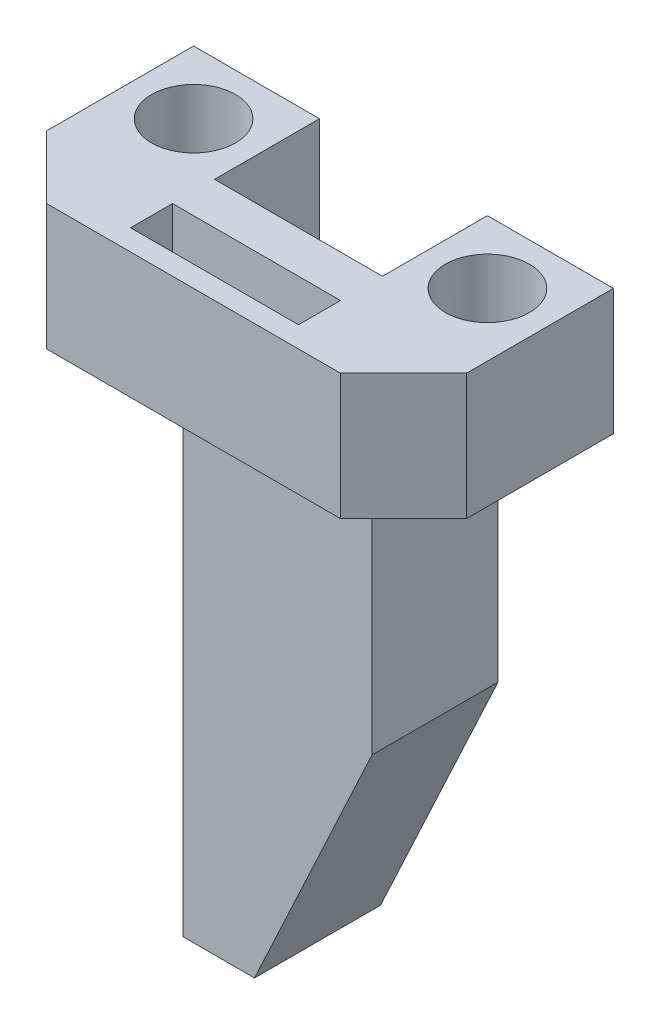
ISO-10303-21;
HEADER;
FILE_DESCRIPTION(('STEP AP214'),'2;1');
FILE_NAME('part.step','',(''),(''),'','','');
FILE_SCHEMA(('AUTOMOTIVE_DESIGN { 1 0 10303 214 1 1 1 1 }'));
ENDSEC;
DATA;
#1=APPLICATION_CONTEXT('core data for automotive mechanical design processes');
#2=APPLICATION_PROTOCOL_DEFINITION('international standard','automotive_design',2000,#1);
#3=PRODUCT_CONTEXT('',#1,'mechanical');
#4=PRODUCT('Part','Part','',(#3));
#5=PRODUCT_RELATED_PRODUCT_CATEGORY('part','',(#4));
#6=PRODUCT_DEFINITION_FORMATION('','',#4);
#7=PRODUCT_DEFINITION_CONTEXT('part definition',#1,'design');
#8=PRODUCT_DEFINITION('design','',#6,#7);
#9=PRODUCT_DEFINITION_SHAPE('','',#8);
#10=(LENGTH_UNIT() NAMED_UNIT(*) SI_UNIT(.MILLI.,.METRE.));
#11=(NAMED_UNIT(*) PLANE_ANGLE_UNIT() SI_UNIT($,.RADIAN.));
#12=(NAMED_UNIT(*) SI_UNIT($,.STERADIAN.) SOLID_ANGLE_UNIT());
#13=UNCERTAINTY_MEASURE_WITH_UNIT(LENGTH_MEASURE(1.E-05),#10,'distance_accuracy_value','');
#14=(GEOMETRIC_REPRESENTATION_CONTEXT(3) GLOBAL_UNCERTAINTY_ASSIGNED_CONTEXT((#13)) GLOBAL_UNIT_ASSIGNED_CONTEXT((#10,
#11,#12)) REPRESENTATION_CONTEXT('',''));
#15=CARTESIAN_POINT('',(0.,0.,0.));
#16=DIRECTION('',(0.,0.,1.));
#17=DIRECTION('',(1.,0.,0.));
#18=AXIS2_PLACEMENT_3D('',#15,#16,#17);
#19=CARTESIAN_POINT('',(0.,0.,0.));
#20=DIRECTION('',(0.,1.,0.));
#21=DIRECTION('',(0.,0.,1.));
#22=AXIS2_PLACEMENT_3D('',#19,#20,#21);
#23=PLANE('',#22);
#24=CARTESIAN_POINT('',(-7.,0.,-7.));
#25=DIRECTION('',(0.,1.,0.));
#26=DIRECTION('',(0.,0.,1.));
#27=AXIS2_PLACEMENT_3D('',#24,#25,#26);
#28=CIRCLE('',#27,2.);
#29=CARTESIAN_POINT('',(-7.,0.,-5.));
#30=VERTEX_POINT('',#29);
#31=EDGE_CURVE('E252',#30,#30,#28,.F.);
#32=ORIENTED_EDGE('',*,*,#31,.F.);
#33=EDGE_LOOP('',(#32));
#34=FACE_BOUND('',#33,.T.);
#35=CARTESIAN_POINT('',(7.,0.,-7.));
#36=DIRECTION('',(0.,1.,0.));
#37=DIRECTION('',(0.,0.,1.));
#38=AXIS2_PLACEMENT_3D('',#35,#36,#37);
#39=CIRCLE('',#38,2.);
#40=CARTESIAN_POINT('',(7.,0.,-5.));
#41=VERTEX_POINT('',#40);
#42=EDGE_CURVE('E246',#41,#41,#39,.F.);
#43=ORIENTED_EDGE('',*,*,#42,.F.);
#44=EDGE_LOOP('',(#43));
#45=FACE_BOUND('',#44,.T.);
#46=DIRECTION('',(1.,0.,0.));
#47=VECTOR('',#46,1.);
#48=CARTESIAN_POINT('',(-4.,0.,-3.));
#49=LINE('',#48,#47);
#50=CARTESIAN_POINT('',(-4.,0.,-3.));
#51=VERTEX_POINT('',#50);
#52=CARTESIAN_POINT('',(4.,0.,-3.));
#53=VERTEX_POINT('',#52);
#54=EDGE_CURVE('E189',#51,#53,#49,.T.);
#55=ORIENTED_EDGE('',*,*,#54,.F.);
#56=DIRECTION('',(0.,0.,-1.));
#57=VECTOR('',#56,1.);
#58=CARTESIAN_POINT('',(-4.,0.,-3.));
#59=LINE('',#58,#57);
#60=CARTESIAN_POINT('',(-4.,0.,-0.999999999999999));
#61=VERTEX_POINT('',#60);
#62=EDGE_CURVE('E217',#61,#51,#59,.T.);
#63=ORIENTED_EDGE('',*,*,#62,.F.);
#64=DIRECTION('',(-1.,0.,0.));
#65=VECTOR('',#64,1.);
#66=CARTESIAN_POINT('',(-4.,0.,-0.999999999999999));
#67=LINE('',#66,#65);
#68=CARTESIAN_POINT('',(4.,0.,-0.999999999999999));
#69=VERTEX_POINT('',#68);
#70=EDGE_CURVE('E234',#69,#61,#67,.T.);
#71=ORIENTED_EDGE('',*,*,#70,.F.);
#72=DIRECTION('',(0.,0.,1.));
#73=VECTOR('',#72,1.);
#74=CARTESIAN_POINT('',(4.,0.,-3.));
#75=LINE('',#74,#73);
#76=EDGE_CURVE('E186',#53,#69,#75,.T.);
#77=ORIENTED_EDGE('',*,*,#76,.F.);
#78=EDGE_LOOP('',(#55,#63,#71,#77));
#79=FACE_BOUND('',#78,.T.);
#80=DIRECTION('',(0.,0.,-1.));
#81=VECTOR('',#80,1.);
#82=CARTESIAN_POINT('',(-4.5,0.,-4.));
#83=LINE('',#82,#81);
#84=CARTESIAN_POINT('',(-4.5,0.,-4.));
#85=VERTEX_POINT('',#84);
#86=CARTESIAN_POINT('',(-4.5,0.,-10.));
#87=VERTEX_POINT('',#86);
#88=EDGE_CURVE('E185',#85,#87,#83,.T.);
#89=ORIENTED_EDGE('',*,*,#88,.F.);
#90=DIRECTION('',(-1.,0.,0.));
#91=VECTOR('',#90,1.);
#92=CARTESIAN_POINT('',(-4.5,0.,-4.));
#93=LINE('',#92,#91);
#94=CARTESIAN_POINT('',(4.5,0.,-4.));
#95=VERTEX_POINT('',#94);
#96=EDGE_CURVE('E182',#95,#85,#93,.T.);
#97=ORIENTED_EDGE('',*,*,#96,.F.);
#98=DIRECTION('',(0.,0.,1.));
#99=VECTOR('',#98,1.);
#100=CARTESIAN_POINT('',(4.5,0.,-4.));
#101=LINE('',#100,#99);
#102=CARTESIAN_POINT('',(4.5,0.,-10.));
#103=VERTEX_POINT('',#102);
#104=EDGE_CURVE('E213',#103,#95,#101,.T.);
#105=ORIENTED_EDGE('',*,*,#104,.F.);
#106=DIRECTION('',(-1.,0.,0.));
#107=VECTOR('',#106,1.);
#108=CARTESIAN_POINT('',(4.,0.,-10.));
#109=LINE('',#108,#107);
#110=CARTESIAN_POINT('',(10.,0.,-10.));
#111=VERTEX_POINT('',#110);
#112=EDGE_CURVE('E281',#111,#103,#109,.T.);
#113=ORIENTED_EDGE('',*,*,#112,.F.);
#114=DIRECTION('',(0.,0.,-1.));
#115=VECTOR('',#114,1.);
#116=CARTESIAN_POINT('',(10.,0.,-10.));
#117=LINE('',#116,#115);
#118=CARTESIAN_POINT('',(10.,0.,-3.));
#119=VERTEX_POINT('',#118);
#120=EDGE_CURVE('E279',#119,#111,#117,.T.);
#121=ORIENTED_EDGE('',*,*,#120,.F.);
#122=DIRECTION('',(0.707106781186549,0.,-0.707106781186546));
#123=VECTOR('',#122,1.);
#124=CARTESIAN_POINT('',(10.,0.,-3.));
#125=LINE('',#124,#123);
#126=CARTESIAN_POINT('',(6.99999999999999,0.,0.));
#127=VERTEX_POINT('',#126);
#128=EDGE_CURVE('E316',#119,#127,#125,.F.);
#129=ORIENTED_EDGE('',*,*,#128,.T.);
#130=DIRECTION('',(1.,0.,0.));
#131=VECTOR('',#130,1.);
#132=CARTESIAN_POINT('',(-10.,0.,0.));
#133=LINE('',#132,#131);
#134=CARTESIAN_POINT('',(-7.,0.,0.));
#135=VERTEX_POINT('',#134);
#136=EDGE_CURVE('E255',#135,#127,#133,.T.);
#137=ORIENTED_EDGE('',*,*,#136,.F.);
#138=DIRECTION('',(0.707106781186546,0.,0.707106781186549));
#139=VECTOR('',#138,1.);
#140=CARTESIAN_POINT('',(-7.,0.,0.));
#141=LINE('',#140,#139);
#142=CARTESIAN_POINT('',(-10.,0.,-3.00000000000001));
#143=VERTEX_POINT('',#142);
#144=EDGE_CURVE('E318',#135,#143,#141,.F.);
#145=ORIENTED_EDGE('',*,*,#144,.T.);
#146=DIRECTION('',(0.,0.,1.));
#147=VECTOR('',#146,1.);
#148=CARTESIAN_POINT('',(-10.,0.,-10.));
#149=LINE('',#148,#147);
#150=CARTESIAN_POINT('',(-10.,0.,-10.));
#151=VERTEX_POINT('',#150);
#152=EDGE_CURVE('E260',#151,#143,#149,.T.);
#153=ORIENTED_EDGE('',*,*,#152,.F.);
#154=DIRECTION('',(-1.,0.,0.));
#155=VECTOR('',#154,1.);
#156=CARTESIAN_POINT('',(-4.,0.,-10.));
#157=LINE('',#156,#155);
#158=EDGE_CURVE('E291',#87,#151,#157,.T.);
#159=ORIENTED_EDGE('',*,*,#158,.F.);
#160=EDGE_LOOP('',(#89,#97,#105,#113,#121,#129,#137,#145,#153,#159));
#161=FACE_BOUND('',#160,.T.);
#162=ADVANCED_FACE('F35',(#34,#45,#79,#161),#23,.F.);
#163=CARTESIAN_POINT('',(-10.,6.,0.));
#164=DIRECTION('',(0.,0.,-1.));
#165=DIRECTION('',(-1.,0.,0.));
#166=AXIS2_PLACEMENT_3D('',#163,#164,#165);
#167=PLANE('',#166);
#168=ORIENTED_EDGE('',*,*,#136,.T.);
#169=DIRECTION('',(0.,1.,0.));
#170=VECTOR('',#169,1.);
#171=CARTESIAN_POINT('',(6.99999999999999,6.,0.));
#172=LINE('',#171,#170);
#173=CARTESIAN_POINT('',(6.99999999999999,6.,0.));
#174=VERTEX_POINT('',#173);
#175=EDGE_CURVE('E311',#127,#174,#172,.T.);
#176=ORIENTED_EDGE('',*,*,#175,.T.);
#177=DIRECTION('',(1.,0.,0.));
#178=VECTOR('',#177,1.);
#179=CARTESIAN_POINT('',(-10.,6.,0.));
#180=LINE('',#179,#178);
#181=CARTESIAN_POINT('',(-7.,6.,0.));
#182=VERTEX_POINT('',#181);
#183=EDGE_CURVE('E259',#182,#174,#180,.T.);
#184=ORIENTED_EDGE('',*,*,#183,.F.);
#185=DIRECTION('',(0.,-1.,0.));
#186=VECTOR('',#185,1.);
#187=CARTESIAN_POINT('',(-7.,6.,0.));
#188=LINE('',#187,#186);
#189=EDGE_CURVE('E313',#182,#135,#188,.T.);
#190=ORIENTED_EDGE('',*,*,#189,.T.);
#191=EDGE_LOOP('',(#168,#176,#184,#190));
#192=FACE_BOUND('',#191,.T.);
#193=ADVANCED_FACE('F376',(#192),#167,.F.);
#194=CARTESIAN_POINT('',(10.,6.,-10.));
#195=DIRECTION('',(-1.,0.,0.));
#196=DIRECTION('',(0.,0.,1.));
#197=AXIS2_PLACEMENT_3D('',#194,#195,#196);
#198=PLANE('',#197);
#199=DIRECTION('',(0.,0.,-1.));
#200=VECTOR('',#199,1.);
#201=CARTESIAN_POINT('',(10.,6.,0.));
#202=LINE('',#201,#200);
#203=CARTESIAN_POINT('',(10.,6.,-3.));
#204=VERTEX_POINT('',#203);
#205=CARTESIAN_POINT('',(10.,6.,-10.));
#206=VERTEX_POINT('',#205);
#207=EDGE_CURVE('E263',#204,#206,#202,.T.);
#208=ORIENTED_EDGE('',*,*,#207,.F.);
#209=DIRECTION('',(0.,-1.,0.));
#210=VECTOR('',#209,1.);
#211=CARTESIAN_POINT('',(10.,6.,-3.));
#212=LINE('',#211,#210);
#213=EDGE_CURVE('E320',#204,#119,#212,.T.);
#214=ORIENTED_EDGE('',*,*,#213,.T.);
#215=ORIENTED_EDGE('',*,*,#120,.T.);
#216=DIRECTION('',(0.,-1.,0.));
#217=VECTOR('',#216,1.);
#218=CARTESIAN_POINT('',(10.,6.,-10.));
#219=LINE('',#218,#217);
#220=EDGE_CURVE('E323',#206,#111,#219,.T.);
#221=ORIENTED_EDGE('',*,*,#220,.F.);
#222=EDGE_LOOP('',(#208,#214,#215,#221));
#223=FACE_BOUND('',#222,.T.);
#224=ADVANCED_FACE('F369',(#223),#198,.F.);
#225=CARTESIAN_POINT('',(4.,6.,-5.));
#226=DIRECTION('',(1.,0.,0.));
#227=DIRECTION('',(0.,0.,-1.));
#228=AXIS2_PLACEMENT_3D('',#225,#226,#227);
#229=PLANE('',#228);
#230=DIRECTION('',(0.,0.,1.));
#231=VECTOR('',#230,1.);
#232=CARTESIAN_POINT('',(4.,0.,-5.));
#233=LINE('',#232,#231);
#234=CARTESIAN_POINT('',(4.,0.,-10.));
#235=VERTEX_POINT('',#234);
#236=CARTESIAN_POINT('',(4.,0.,-5.));
#237=VERTEX_POINT('',#236);
#238=EDGE_CURVE('E290',#235,#237,#233,.T.);
#239=ORIENTED_EDGE('',*,*,#238,.T.);
#240=DIRECTION('',(0.,-1.,0.));
#241=VECTOR('',#240,1.);
#242=CARTESIAN_POINT('',(4.,6.,-5.));
#243=LINE('',#242,#241);
#244=CARTESIAN_POINT('',(4.,6.,-5.));
#245=VERTEX_POINT('',#244);
#246=EDGE_CURVE('E326',#245,#237,#243,.T.);
#247=ORIENTED_EDGE('',*,*,#246,.F.);
#248=DIRECTION('',(0.,0.,1.));
#249=VECTOR('',#248,1.);
#250=CARTESIAN_POINT('',(4.,6.,-5.));
#251=LINE('',#250,#249);
#252=CARTESIAN_POINT('',(4.,6.,-10.));
#253=VERTEX_POINT('',#252);
#254=EDGE_CURVE('E267',#253,#245,#251,.T.);
#255=ORIENTED_EDGE('',*,*,#254,.F.);
#256=DIRECTION('',(0.,-1.,0.));
#257=VECTOR('',#256,1.);
#258=CARTESIAN_POINT('',(4.,6.,-10.));
#259=LINE('',#258,#257);
#260=EDGE_CURVE('E300',#253,#235,#259,.T.);
#261=ORIENTED_EDGE('',*,*,#260,.T.);
#262=EDGE_LOOP('',(#239,#247,#255,#261));
#263=FACE_BOUND('',#262,.T.);
#264=ADVANCED_FACE('F367',(#263),#229,.F.);
#265=CARTESIAN_POINT('',(-4.,6.,-5.));
#266=DIRECTION('',(0.,0.,1.));
#267=DIRECTION('',(1.,0.,0.));
#268=AXIS2_PLACEMENT_3D('',#265,#266,#267);
#269=PLANE('',#268);
#270=DIRECTION('',(-1.,0.,0.));
#271=VECTOR('',#270,1.);
#272=CARTESIAN_POINT('',(-4.,0.,-5.));
#273=LINE('',#272,#271);
#274=CARTESIAN_POINT('',(-4.,0.,-5.));
#275=VERTEX_POINT('',#274);
#276=EDGE_CURVE('E336',#237,#275,#273,.T.);
#277=ORIENTED_EDGE('',*,*,#276,.T.);
#278=DIRECTION('',(0.,-1.,0.));
#279=VECTOR('',#278,1.);
#280=CARTESIAN_POINT('',(-4.,6.,-5.));
#281=LINE('',#280,#279);
#282=CARTESIAN_POINT('',(-4.,6.,-5.));
#283=VERTEX_POINT('',#282);
#284=EDGE_CURVE('E329',#283,#275,#281,.T.);
#285=ORIENTED_EDGE('',*,*,#284,.F.);
#286=DIRECTION('',(-1.,0.,0.));
#287=VECTOR('',#286,1.);
#288=CARTESIAN_POINT('',(-4.,6.,-5.));
#289=LINE('',#288,#287);
#290=EDGE_CURVE('E269',#245,#283,#289,.T.);
#291=ORIENTED_EDGE('',*,*,#290,.F.);
#292=ORIENTED_EDGE('',*,*,#246,.T.);
#293=EDGE_LOOP('',(#277,#285,#291,#292));
#294=FACE_BOUND('',#293,.T.);
#295=ADVANCED_FACE('F362',(#294),#269,.F.);
#296=CARTESIAN_POINT('',(-4.,6.,-5.));
#297=DIRECTION('',(-1.,0.,0.));
#298=DIRECTION('',(0.,0.,1.));
#299=AXIS2_PLACEMENT_3D('',#296,#297,#298);
#300=PLANE('',#299);
#301=DIRECTION('',(0.,0.,-1.));
#302=VECTOR('',#301,1.);
#303=CARTESIAN_POINT('',(-4.,0.,-5.));
#304=LINE('',#303,#302);
#305=CARTESIAN_POINT('',(-4.,0.,-10.));
#306=VERTEX_POINT('',#305);
#307=EDGE_CURVE('E337',#275,#306,#304,.T.);
#308=ORIENTED_EDGE('',*,*,#307,.T.);
#309=DIRECTION('',(0.,-1.,0.));
#310=VECTOR('',#309,1.);
#311=CARTESIAN_POINT('',(-4.,6.,-10.));
#312=LINE('',#311,#310);
#313=CARTESIAN_POINT('',(-4.,6.,-10.));
#314=VERTEX_POINT('',#313);
#315=EDGE_CURVE('E332',#314,#306,#312,.T.);
#316=ORIENTED_EDGE('',*,*,#315,.F.);
#317=DIRECTION('',(0.,0.,-1.));
#318=VECTOR('',#317,1.);
#319=CARTESIAN_POINT('',(-4.,6.,-5.));
#320=LINE('',#319,#318);
#321=EDGE_CURVE('E271',#283,#314,#320,.T.);
#322=ORIENTED_EDGE('',*,*,#321,.F.);
#323=ORIENTED_EDGE('',*,*,#284,.T.);
#324=EDGE_LOOP('',(#308,#316,#322,#323));
#325=FACE_BOUND('',#324,.T.);
#326=ADVANCED_FACE('F360',(#325),#300,.F.);
#327=CARTESIAN_POINT('',(-4.,6.,-10.));
#328=DIRECTION('',(0.,0.,1.));
#329=DIRECTION('',(1.,0.,0.));
#330=AXIS2_PLACEMENT_3D('',#327,#328,#329);
#331=PLANE('',#330);
#332=DIRECTION('',(0.,1.,0.));
#333=VECTOR('',#332,1.);
#334=CARTESIAN_POINT('',(4.5,-25.,-10.));
#335=LINE('',#334,#333);
#336=CARTESIAN_POINT('',(4.5,-12.9999999999999,-10.));
#337=VERTEX_POINT('',#336);
#338=EDGE_CURVE('E187',#337,#103,#335,.T.);
#339=ORIENTED_EDGE('',*,*,#338,.F.);
#340=DIRECTION('',(-0.422618261740697,-0.906307787036651,0.));
#341=VECTOR('',#340,1.);
#342=CARTESIAN_POINT('',(-1.09569189785999,-25.,-10.));
#343=LINE('',#342,#341);
#344=CARTESIAN_POINT('',(-1.09569189785999,-25.,-10.));
#345=VERTEX_POINT('',#344);
#346=EDGE_CURVE('E11',#337,#345,#343,.T.);
#347=ORIENTED_EDGE('',*,*,#346,.T.);
#348=DIRECTION('',(1.,0.,0.));
#349=VECTOR('',#348,1.);
#350=CARTESIAN_POINT('',(-4.5,-25.,-10.));
#351=LINE('',#350,#349);
#352=CARTESIAN_POINT('',(-4.5,-25.,-10.));
#353=VERTEX_POINT('',#352);
#354=EDGE_CURVE('E164',#353,#345,#351,.T.);
#355=ORIENTED_EDGE('',*,*,#354,.F.);
#356=DIRECTION('',(0.,1.,0.));
#357=VECTOR('',#356,1.);
#358=CARTESIAN_POINT('',(-4.5,-25.,-10.));
#359=LINE('',#358,#357);
#360=EDGE_CURVE('E168',#353,#87,#359,.T.);
#361=ORIENTED_EDGE('',*,*,#360,.T.);
#362=ORIENTED_EDGE('',*,*,#158,.T.);
#363=DIRECTION('',(0.,-1.,0.));
#364=VECTOR('',#363,1.);
#365=CARTESIAN_POINT('',(-10.,6.,-10.));
#366=LINE('',#365,#364);
#367=CARTESIAN_POINT('',(-10.,6.,-10.));
#368=VERTEX_POINT('',#367);
#369=EDGE_CURVE('E276',#368,#151,#366,.T.);
#370=ORIENTED_EDGE('',*,*,#369,.F.);
#371=DIRECTION('',(-1.,0.,0.));
#372=VECTOR('',#371,1.);
#373=CARTESIAN_POINT('',(-4.,6.,-10.));
#374=LINE('',#373,#372);
#375=EDGE_CURVE('E273',#314,#368,#374,.T.);
#376=ORIENTED_EDGE('',*,*,#375,.F.);
#377=ORIENTED_EDGE('',*,*,#315,.T.);
#378=DIRECTION('',(1.,0.,0.));
#379=VECTOR('',#378,1.);
#380=CARTESIAN_POINT('',(-4.5,0.,-10.));
#381=LINE('',#380,#379);
#382=EDGE_CURVE('E201',#306,#235,#381,.T.);
#383=ORIENTED_EDGE('',*,*,#382,.T.);
#384=ORIENTED_EDGE('',*,*,#260,.F.);
#385=DIRECTION('',(-1.,0.,0.));
#386=VECTOR('',#385,1.);
#387=CARTESIAN_POINT('',(4.,6.,-10.));
#388=LINE('',#387,#386);
#389=EDGE_CURVE('E265',#206,#253,#388,.T.);
#390=ORIENTED_EDGE('',*,*,#389,.F.);
#391=ORIENTED_EDGE('',*,*,#220,.T.);
#392=ORIENTED_EDGE('',*,*,#112,.T.);
#393=EDGE_LOOP('',(#339,#347,#355,#361,#362,#370,#376,#377,#383,#384,#390,#391,#392));
#394=FACE_BOUND('',#393,.T.);
#395=ADVANCED_FACE('F166',(#394),#331,.F.);
#396=CARTESIAN_POINT('',(-10.,6.,-10.));
#397=DIRECTION('',(1.,0.,0.));
#398=DIRECTION('',(0.,0.,-1.));
#399=AXIS2_PLACEMENT_3D('',#396,#397,#398);
#400=PLANE('',#399);
#401=ORIENTED_EDGE('',*,*,#152,.T.);
#402=DIRECTION('',(0.,1.,0.));
#403=VECTOR('',#402,1.);
#404=CARTESIAN_POINT('',(-10.,6.,-3.00000000000001));
#405=LINE('',#404,#403);
#406=CARTESIAN_POINT('',(-10.,6.,-3.00000000000001));
#407=VERTEX_POINT('',#406);
#408=EDGE_CURVE('E302',#143,#407,#405,.T.);
#409=ORIENTED_EDGE('',*,*,#408,.T.);
#410=DIRECTION('',(0.,0.,1.));
#411=VECTOR('',#410,1.);
#412=CARTESIAN_POINT('',(-10.,6.,0.));
#413=LINE('',#412,#411);
#414=EDGE_CURVE('E256',#368,#407,#413,.T.);
#415=ORIENTED_EDGE('',*,*,#414,.F.);
#416=ORIENTED_EDGE('',*,*,#369,.T.);
#417=EDGE_LOOP('',(#401,#409,#415,#416));
#418=FACE_BOUND('',#417,.T.);
#419=ADVANCED_FACE('F392',(#418),#400,.F.);
#420=CARTESIAN_POINT('',(0.,6.,0.));
#421=DIRECTION('',(0.,1.,0.));
#422=DIRECTION('',(0.,0.,1.));
#423=AXIS2_PLACEMENT_3D('',#420,#421,#422);
#424=PLANE('',#423);
#425=DIRECTION('',(0.,0.,1.));
#426=VECTOR('',#425,1.);
#427=CARTESIAN_POINT('',(-4.,6.,-3.));
#428=LINE('',#427,#426);
#429=CARTESIAN_POINT('',(-4.,6.,-3.));
#430=VERTEX_POINT('',#429);
#431=CARTESIAN_POINT('',(-4.,6.,-0.999999999999999));
#432=VERTEX_POINT('',#431);
#433=EDGE_CURVE('E220',#430,#432,#428,.T.);
#434=ORIENTED_EDGE('',*,*,#433,.F.);
#435=DIRECTION('',(-1.,0.,0.));
#436=VECTOR('',#435,1.);
#437=CARTESIAN_POINT('',(-4.,6.,-3.));
#438=LINE('',#437,#436);
#439=CARTESIAN_POINT('',(4.,6.,-3.));
#440=VERTEX_POINT('',#439);
#441=EDGE_CURVE('E228',#440,#430,#438,.T.);
#442=ORIENTED_EDGE('',*,*,#441,.F.);
#443=DIRECTION('',(0.,0.,-1.));
#444=VECTOR('',#443,1.);
#445=CARTESIAN_POINT('',(4.,6.,-3.));
#446=LINE('',#445,#444);
#447=CARTESIAN_POINT('',(4.,6.,-0.999999999999999));
#448=VERTEX_POINT('',#447);
#449=EDGE_CURVE('E225',#448,#440,#446,.T.);
#450=ORIENTED_EDGE('',*,*,#449,.F.);
#451=DIRECTION('',(1.,0.,0.));
#452=VECTOR('',#451,1.);
#453=CARTESIAN_POINT('',(-4.,6.,-0.999999999999999));
#454=LINE('',#453,#452);
#455=EDGE_CURVE('E222',#432,#448,#454,.T.);
#456=ORIENTED_EDGE('',*,*,#455,.F.);
#457=EDGE_LOOP('',(#434,#442,#450,#456));
#458=FACE_BOUND('',#457,.T.);
#459=CARTESIAN_POINT('',(7.,6.,-7.));
#460=DIRECTION('',(0.,1.,0.));
#461=DIRECTION('',(0.,0.,-1.));
#462=AXIS2_PLACEMENT_3D('',#459,#460,#461);
#463=CIRCLE('',#462,2.);
#464=CARTESIAN_POINT('',(7.,6.,-9.));
#465=VERTEX_POINT('',#464);
#466=EDGE_CURVE('E243',#465,#465,#463,.T.);
#467=ORIENTED_EDGE('',*,*,#466,.F.);
#468=EDGE_LOOP('',(#467));
#469=FACE_BOUND('',#468,.T.);
#470=CARTESIAN_POINT('',(-7.,6.,-7.));
#471=DIRECTION('',(0.,1.,0.));
#472=DIRECTION('',(0.,0.,1.));
#473=AXIS2_PLACEMENT_3D('',#470,#471,#472);
#474=CIRCLE('',#473,2.);
#475=CARTESIAN_POINT('',(-7.,6.,-5.));
#476=VERTEX_POINT('',#475);
#477=EDGE_CURVE('E249',#476,#476,#474,.T.);
#478=ORIENTED_EDGE('',*,*,#477,.F.);
#479=EDGE_LOOP('',(#478));
#480=FACE_BOUND('',#479,.T.);
#481=ORIENTED_EDGE('',*,*,#183,.T.);
#482=DIRECTION('',(-0.707106781186549,0.,0.707106781186546));
#483=VECTOR('',#482,1.);
#484=CARTESIAN_POINT('',(3.49999999999998,6.,3.49999999999999));
#485=LINE('',#484,#483);
#486=EDGE_CURVE('E303',#174,#204,#485,.F.);
#487=ORIENTED_EDGE('',*,*,#486,.T.);
#488=ORIENTED_EDGE('',*,*,#207,.T.);
#489=ORIENTED_EDGE('',*,*,#389,.T.);
#490=ORIENTED_EDGE('',*,*,#254,.T.);
#491=ORIENTED_EDGE('',*,*,#290,.T.);
#492=ORIENTED_EDGE('',*,*,#321,.T.);
#493=ORIENTED_EDGE('',*,*,#375,.T.);
#494=ORIENTED_EDGE('',*,*,#414,.T.);
#495=DIRECTION('',(-0.707106781186546,0.,-0.707106781186549));
#496=VECTOR('',#495,1.);
#497=CARTESIAN_POINT('',(-3.50000000000001,6.,3.5));
#498=LINE('',#497,#496);
#499=EDGE_CURVE('E307',#407,#182,#498,.F.);
#500=ORIENTED_EDGE('',*,*,#499,.T.);
#501=EDGE_LOOP('',(#481,#487,#488,#489,#490,#491,#492,#493,#494,#500));
#502=FACE_BOUND('',#501,.T.);
#503=ADVANCED_FACE('F364',(#458,#469,#480,#502),#424,.T.);
#504=CARTESIAN_POINT('',(-7.,-0.00100000000000013,-7.));
#505=DIRECTION('',(0.,1.,0.));
#506=DIRECTION('',(0.,0.,1.));
#507=AXIS2_PLACEMENT_3D('',#504,#505,#506);
#508=CYLINDRICAL_SURFACE('',#507,2.);
#509=ORIENTED_EDGE('',*,*,#477,.T.);
#510=EDGE_LOOP('',(#509));
#511=FACE_BOUND('',#510,.T.);
#512=ORIENTED_EDGE('',*,*,#31,.T.);
#513=EDGE_LOOP('',(#512));
#514=FACE_BOUND('',#513,.T.);
#515=ADVANCED_FACE('F420',(#511,#514),#508,.F.);
#516=CARTESIAN_POINT('',(7.,-0.00100000000000013,-7.));
#517=DIRECTION('',(0.,1.,0.));
#518=DIRECTION('',(0.,0.,1.));
#519=AXIS2_PLACEMENT_3D('',#516,#517,#518);
#520=CYLINDRICAL_SURFACE('',#519,2.);
#521=ORIENTED_EDGE('',*,*,#466,.T.);
#522=EDGE_LOOP('',(#521));
#523=FACE_BOUND('',#522,.T.);
#524=ORIENTED_EDGE('',*,*,#42,.T.);
#525=EDGE_LOOP('',(#524));
#526=FACE_BOUND('',#525,.T.);
#527=ADVANCED_FACE('F428',(#523,#526),#520,.F.);
#528=CARTESIAN_POINT('',(-4.,-0.00100000000000013,-3.));
#529=DIRECTION('',(-1.,0.,0.));
#530=DIRECTION('',(0.,0.,1.));
#531=AXIS2_PLACEMENT_3D('',#528,#529,#530);
#532=PLANE('',#531);
#533=ORIENTED_EDGE('',*,*,#62,.T.);
#534=DIRECTION('',(0.,1.,0.));
#535=VECTOR('',#534,1.);
#536=CARTESIAN_POINT('',(-4.,-0.00100000000000013,-3.));
#537=LINE('',#536,#535);
#538=EDGE_CURVE('E232',#51,#430,#537,.T.);
#539=ORIENTED_EDGE('',*,*,#538,.T.);
#540=ORIENTED_EDGE('',*,*,#433,.T.);
#541=DIRECTION('',(0.,1.,0.));
#542=VECTOR('',#541,1.);
#543=CARTESIAN_POINT('',(-4.,-0.00100000000000013,-0.999999999999999));
#544=LINE('',#543,#542);
#545=EDGE_CURVE('E231',#61,#432,#544,.T.);
#546=ORIENTED_EDGE('',*,*,#545,.F.);
#547=EDGE_LOOP('',(#533,#539,#540,#546));
#548=FACE_BOUND('',#547,.T.);
#549=ADVANCED_FACE('F435',(#548),#532,.F.);
#550=CARTESIAN_POINT('',(-4.,-0.00100000000000013,-3.));
#551=DIRECTION('',(0.,0.,-1.));
#552=DIRECTION('',(-1.,0.,0.));
#553=AXIS2_PLACEMENT_3D('',#550,#551,#552);
#554=PLANE('',#553);
#555=ORIENTED_EDGE('',*,*,#54,.T.);
#556=DIRECTION('',(0.,1.,0.));
#557=VECTOR('',#556,1.);
#558=CARTESIAN_POINT('',(4.,-0.00100000000000013,-3.));
#559=LINE('',#558,#557);
#560=EDGE_CURVE('E235',#53,#440,#559,.T.);
#561=ORIENTED_EDGE('',*,*,#560,.T.);
#562=ORIENTED_EDGE('',*,*,#441,.T.);
#563=ORIENTED_EDGE('',*,*,#538,.F.);
#564=EDGE_LOOP('',(#555,#561,#562,#563));
#565=FACE_BOUND('',#564,.T.);
#566=ADVANCED_FACE('F443',(#565),#554,.F.);
#567=CARTESIAN_POINT('',(4.,-0.00100000000000013,-3.));
#568=DIRECTION('',(1.,0.,0.));
#569=DIRECTION('',(0.,0.,-1.));
#570=AXIS2_PLACEMENT_3D('',#567,#568,#569);
#571=PLANE('',#570);
#572=ORIENTED_EDGE('',*,*,#76,.T.);
#573=DIRECTION('',(0.,1.,0.));
#574=VECTOR('',#573,1.);
#575=CARTESIAN_POINT('',(4.,-0.00100000000000013,-0.999999999999999));
#576=LINE('',#575,#574);
#577=EDGE_CURVE('E237',#69,#448,#576,.T.);
#578=ORIENTED_EDGE('',*,*,#577,.T.);
#579=ORIENTED_EDGE('',*,*,#449,.T.);
#580=ORIENTED_EDGE('',*,*,#560,.F.);
#581=EDGE_LOOP('',(#572,#578,#579,#580));
#582=FACE_BOUND('',#581,.T.);
#583=ADVANCED_FACE('F451',(#582),#571,.F.);
#584=CARTESIAN_POINT('',(-4.,-0.00100000000000013,-0.999999999999999));
#585=DIRECTION('',(0.,0.,1.));
#586=DIRECTION('',(1.,0.,0.));
#587=AXIS2_PLACEMENT_3D('',#584,#585,#586);
#588=PLANE('',#587);
#589=ORIENTED_EDGE('',*,*,#70,.T.);
#590=ORIENTED_EDGE('',*,*,#545,.T.);
#591=ORIENTED_EDGE('',*,*,#455,.T.);
#592=ORIENTED_EDGE('',*,*,#577,.F.);
#593=EDGE_LOOP('',(#589,#590,#591,#592));
#594=FACE_BOUND('',#593,.T.);
#595=ADVANCED_FACE('F459',(#594),#588,.F.);
#596=CARTESIAN_POINT('',(10.,6.,-3.));
#597=DIRECTION('',(-0.707106781186546,0.,-0.707106781186549));
#598=DIRECTION('',(0.,-1.,0.));
#599=AXIS2_PLACEMENT_3D('',#596,#597,#598);
#600=PLANE('',#599);
#601=ORIENTED_EDGE('',*,*,#486,.F.);
#602=ORIENTED_EDGE('',*,*,#175,.F.);
#603=ORIENTED_EDGE('',*,*,#128,.F.);
#604=ORIENTED_EDGE('',*,*,#213,.F.);
#605=EDGE_LOOP('',(#601,#602,#603,#604));
#606=FACE_BOUND('',#605,.T.);
#607=ADVANCED_FACE('F467',(#606),#600,.F.);
#608=CARTESIAN_POINT('',(-7.,6.,0.));
#609=DIRECTION('',(0.707106781186549,0.,-0.707106781186546));
#610=DIRECTION('',(0.,-1.,0.));
#611=AXIS2_PLACEMENT_3D('',#608,#609,#610);
#612=PLANE('',#611);
#613=ORIENTED_EDGE('',*,*,#499,.F.);
#614=ORIENTED_EDGE('',*,*,#408,.F.);
#615=ORIENTED_EDGE('',*,*,#144,.F.);
#616=ORIENTED_EDGE('',*,*,#189,.F.);
#617=EDGE_LOOP('',(#613,#614,#615,#616));
#618=FACE_BOUND('',#617,.T.);
#619=ADVANCED_FACE('F475',(#618),#612,.F.);
#620=CARTESIAN_POINT('',(-4.5,-25.,-4.));
#621=DIRECTION('',(1.,0.,0.));
#622=DIRECTION('',(0.,0.,-1.));
#623=AXIS2_PLACEMENT_3D('',#620,#621,#622);
#624=PLANE('',#623);
#625=ORIENTED_EDGE('',*,*,#88,.T.);
#626=ORIENTED_EDGE('',*,*,#360,.F.);
#627=DIRECTION('',(0.,0.,-1.));
#628=VECTOR('',#627,1.);
#629=CARTESIAN_POINT('',(-4.5,-25.,-4.));
#630=LINE('',#629,#628);
#631=CARTESIAN_POINT('',(-4.5,-25.,-4.));
#632=VERTEX_POINT('',#631);
#633=EDGE_CURVE('E175',#632,#353,#630,.T.);
#634=ORIENTED_EDGE('',*,*,#633,.F.);
#635=DIRECTION('',(0.,1.,0.));
#636=VECTOR('',#635,1.);
#637=CARTESIAN_POINT('',(-4.5,-25.,-4.));
#638=LINE('',#637,#636);
#639=EDGE_CURVE('E591',#632,#85,#638,.T.);
#640=ORIENTED_EDGE('',*,*,#639,.T.);
#641=EDGE_LOOP('',(#625,#626,#634,#640));
#642=FACE_BOUND('',#641,.T.);
#643=ADVANCED_FACE('F184',(#642),#624,.F.);
#644=CARTESIAN_POINT('',(4.5,-25.,-4.));
#645=DIRECTION('',(-1.,0.,0.));
#646=DIRECTION('',(0.,0.,1.));
#647=AXIS2_PLACEMENT_3D('',#644,#645,#646);
#648=PLANE('',#647);
#649=DIRECTION('',(0.,1.,0.));
#650=VECTOR('',#649,1.);
#651=CARTESIAN_POINT('',(4.5,-25.,-4.));
#652=LINE('',#651,#650);
#653=CARTESIAN_POINT('',(4.5,-12.9999999999999,-4.));
#654=VERTEX_POINT('',#653);
#655=EDGE_CURVE('E191',#654,#95,#652,.T.);
#656=ORIENTED_EDGE('',*,*,#655,.F.);
#657=DIRECTION('',(0.,0.,-1.));
#658=VECTOR('',#657,1.);
#659=CARTESIAN_POINT('',(4.5,-12.9999999999999,-10.));
#660=LINE('',#659,#658);
#661=EDGE_CURVE('E43',#654,#337,#660,.T.);
#662=ORIENTED_EDGE('',*,*,#661,.T.);
#663=ORIENTED_EDGE('',*,*,#338,.T.);
#664=ORIENTED_EDGE('',*,*,#104,.T.);
#665=EDGE_LOOP('',(#656,#662,#663,#664));
#666=FACE_BOUND('',#665,.T.);
#667=ADVANCED_FACE('F488',(#666),#648,.F.);
#668=CARTESIAN_POINT('',(-4.5,-25.,-4.));
#669=DIRECTION('',(0.,0.,-1.));
#670=DIRECTION('',(-1.,0.,0.));
#671=AXIS2_PLACEMENT_3D('',#668,#669,#670);
#672=PLANE('',#671);
#673=DIRECTION('',(-1.,0.,0.));
#674=VECTOR('',#673,1.);
#675=CARTESIAN_POINT('',(-4.5,-25.,-4.));
#676=LINE('',#675,#674);
#677=CARTESIAN_POINT('',(-1.09569189785999,-25.,-4.));
#678=VERTEX_POINT('',#677);
#679=EDGE_CURVE('E174',#678,#632,#676,.T.);
#680=ORIENTED_EDGE('',*,*,#679,.F.);
#681=DIRECTION('',(0.422618261740697,0.906307787036651,0.));
#682=VECTOR('',#681,1.);
#683=CARTESIAN_POINT('',(-1.09569189785999,-25.,-4.));
#684=LINE('',#683,#682);
#685=EDGE_CURVE('E57',#678,#654,#684,.T.);
#686=ORIENTED_EDGE('',*,*,#685,.T.);
#687=ORIENTED_EDGE('',*,*,#655,.T.);
#688=ORIENTED_EDGE('',*,*,#96,.T.);
#689=ORIENTED_EDGE('',*,*,#639,.F.);
#690=EDGE_LOOP('',(#680,#686,#687,#688,#689));
#691=FACE_BOUND('',#690,.T.);
#692=ADVANCED_FACE('F494',(#691),#672,.F.);
#693=CARTESIAN_POINT('',(0.,-25.,0.));
#694=DIRECTION('',(0.,-1.,0.));
#695=DIRECTION('',(0.,0.,-1.));
#696=AXIS2_PLACEMENT_3D('',#693,#694,#695);
#697=PLANE('',#696);
#698=ORIENTED_EDGE('',*,*,#354,.T.);
#699=DIRECTION('',(0.,0.,1.));
#700=VECTOR('',#699,1.);
#701=CARTESIAN_POINT('',(-1.09569189785999,-25.,-4.));
#702=LINE('',#701,#700);
#703=EDGE_CURVE('E202',#345,#678,#702,.T.);
#704=ORIENTED_EDGE('',*,*,#703,.T.);
#705=ORIENTED_EDGE('',*,*,#679,.T.);
#706=ORIENTED_EDGE('',*,*,#633,.T.);
#707=EDGE_LOOP('',(#698,#704,#705,#706));
#708=FACE_BOUND('',#707,.T.);
#709=ADVANCED_FACE('F178',(#708),#697,.T.);
#710=CARTESIAN_POINT('',(0.,0.,0.));
#711=DIRECTION('',(0.,-1.,0.));
#712=DIRECTION('',(0.,0.,-1.));
#713=AXIS2_PLACEMENT_3D('',#710,#711,#712);
#714=PLANE('',#713);
#715=ORIENTED_EDGE('',*,*,#307,.F.);
#716=ORIENTED_EDGE('',*,*,#276,.F.);
#717=ORIENTED_EDGE('',*,*,#238,.F.);
#718=ORIENTED_EDGE('',*,*,#382,.F.);
#719=EDGE_LOOP('',(#715,#716,#717,#718));
#720=FACE_BOUND('',#719,.T.);
#721=ADVANCED_FACE('F359',(#720),#714,.F.);
#722=CARTESIAN_POINT('',(-1.09569189785999,-25.,0.));
#723=DIRECTION('',(0.906307787036651,-0.422618261740697,0.));
#724=DIRECTION('',(0.,0.,-1.));
#725=AXIS2_PLACEMENT_3D('',#722,#723,#724);
#726=PLANE('',#725);
#727=ORIENTED_EDGE('',*,*,#346,.F.);
#728=ORIENTED_EDGE('',*,*,#661,.F.);
#729=ORIENTED_EDGE('',*,*,#685,.F.);
#730=ORIENTED_EDGE('',*,*,#703,.F.);
#731=EDGE_LOOP('',(#727,#728,#729,#730));
#732=FACE_BOUND('',#731,.T.);
#733=ADVANCED_FACE('F37',(#732),#726,.T.);
#734=CLOSED_SHELL('',(#162,#193,#224,#264,#295,#326,#395,#419,#503,#515,#527,#549,#566,#583,
#595,#607,#619,#643,#667,#692,#709,#721,#733));
#735=MANIFOLD_SOLID_BREP('B2',#734);
#736=ADVANCED_BREP_SHAPE_REPRESENTATION('',(#18,#735),#14);
#737=SHAPE_DEFINITION_REPRESENTATION(#9,#736);
ENDSEC;
END-ISO-10303-21;
